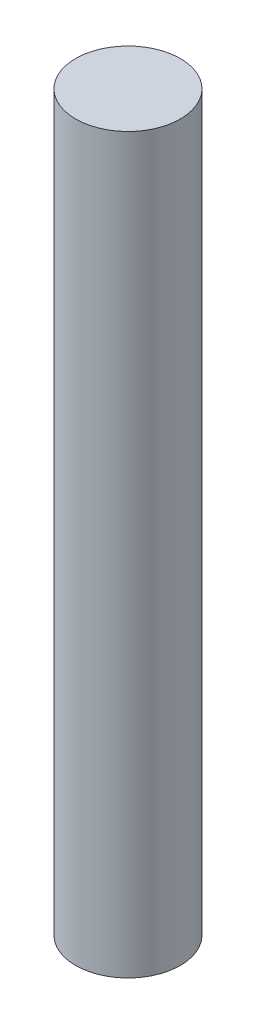
ISO-10303-21;
HEADER;
FILE_DESCRIPTION(('STEP AP214'),'2;1');
FILE_NAME('part.step','',(''),(''),'','','');
FILE_SCHEMA(('AUTOMOTIVE_DESIGN { 1 0 10303 214 1 1 1 1 }'));
ENDSEC;
DATA;
#1=APPLICATION_CONTEXT('core data for automotive mechanical design processes');
#2=APPLICATION_PROTOCOL_DEFINITION('international standard','automotive_design',2000,#1);
#3=PRODUCT_CONTEXT('',#1,'mechanical');
#4=PRODUCT('Part','Part','',(#3));
#5=PRODUCT_RELATED_PRODUCT_CATEGORY('part','',(#4));
#6=PRODUCT_DEFINITION_FORMATION('','',#4);
#7=PRODUCT_DEFINITION_CONTEXT('part definition',#1,'design');
#8=PRODUCT_DEFINITION('design','',#6,#7);
#9=PRODUCT_DEFINITION_SHAPE('','',#8);
#10=(LENGTH_UNIT() NAMED_UNIT(*) SI_UNIT(.MILLI.,.METRE.));
#11=(NAMED_UNIT(*) PLANE_ANGLE_UNIT() SI_UNIT($,.RADIAN.));
#12=(NAMED_UNIT(*) SI_UNIT($,.STERADIAN.) SOLID_ANGLE_UNIT());
#13=UNCERTAINTY_MEASURE_WITH_UNIT(LENGTH_MEASURE(1.E-05),#10,'distance_accuracy_value','');
#14=(GEOMETRIC_REPRESENTATION_CONTEXT(3) GLOBAL_UNCERTAINTY_ASSIGNED_CONTEXT((#13)) GLOBAL_UNIT_ASSIGNED_CONTEXT((#10,
#11,#12)) REPRESENTATION_CONTEXT('',''));
#15=CARTESIAN_POINT('',(0.,0.,0.));
#16=DIRECTION('',(0.,0.,1.));
#17=DIRECTION('',(1.,0.,0.));
#18=AXIS2_PLACEMENT_3D('',#15,#16,#17);
#19=CARTESIAN_POINT('',(0.,70.,0.));
#20=DIRECTION('',(0.,-1.,0.));
#21=DIRECTION('',(0.,0.,-1.));
#22=AXIS2_PLACEMENT_3D('',#19,#20,#21);
#23=CYLINDRICAL_SURFACE('',#22,5.);
#24=CARTESIAN_POINT('',(0.,70.,0.));
#25=DIRECTION('',(0.,1.,0.));
#26=DIRECTION('',(0.,0.,1.));
#27=AXIS2_PLACEMENT_3D('',#24,#25,#26);
#28=CIRCLE('',#27,5.);
#29=CARTESIAN_POINT('',(0.,70.,5.));
#30=VERTEX_POINT('',#29);
#31=EDGE_CURVE('E10',#30,#30,#28,.T.);
#32=ORIENTED_EDGE('',*,*,#31,.F.);
#33=EDGE_LOOP('',(#32));
#34=FACE_BOUND('',#33,.T.);
#35=CARTESIAN_POINT('',(0.,0.,0.));
#36=DIRECTION('',(0.,1.,0.));
#37=DIRECTION('',(0.,0.,1.));
#38=AXIS2_PLACEMENT_3D('',#35,#36,#37);
#39=CIRCLE('',#38,5.);
#40=CARTESIAN_POINT('',(0.,0.,5.));
#41=VERTEX_POINT('',#40);
#42=EDGE_CURVE('E34',#41,#41,#39,.T.);
#43=ORIENTED_EDGE('',*,*,#42,.T.);
#44=EDGE_LOOP('',(#43));
#45=FACE_BOUND('',#44,.T.);
#46=ADVANCED_FACE('F31',(#34,#45),#23,.T.);
#47=CARTESIAN_POINT('',(0.,70.,0.));
#48=DIRECTION('',(0.,1.,0.));
#49=DIRECTION('',(0.,0.,1.));
#50=AXIS2_PLACEMENT_3D('',#47,#48,#49);
#51=PLANE('',#50);
#52=ORIENTED_EDGE('',*,*,#31,.T.);
#53=EDGE_LOOP('',(#52));
#54=FACE_BOUND('',#53,.T.);
#55=ADVANCED_FACE('F46',(#54),#51,.T.);
#56=CARTESIAN_POINT('',(0.,0.,0.));
#57=DIRECTION('',(0.,1.,0.));
#58=DIRECTION('',(0.,0.,1.));
#59=AXIS2_PLACEMENT_3D('',#56,#57,#58);
#60=PLANE('',#59);
#61=ORIENTED_EDGE('',*,*,#42,.F.);
#62=EDGE_LOOP('',(#61));
#63=FACE_BOUND('',#62,.T.);
#64=ADVANCED_FACE('F44',(#63),#60,.F.);
#65=CLOSED_SHELL('',(#46,#55,#64));
#66=MANIFOLD_SOLID_BREP('B2',#65);
#67=ADVANCED_BREP_SHAPE_REPRESENTATION('',(#18,#66),#14);
#68=SHAPE_DEFINITION_REPRESENTATION(#9,#67);
ENDSEC;
END-ISO-10303-21;
